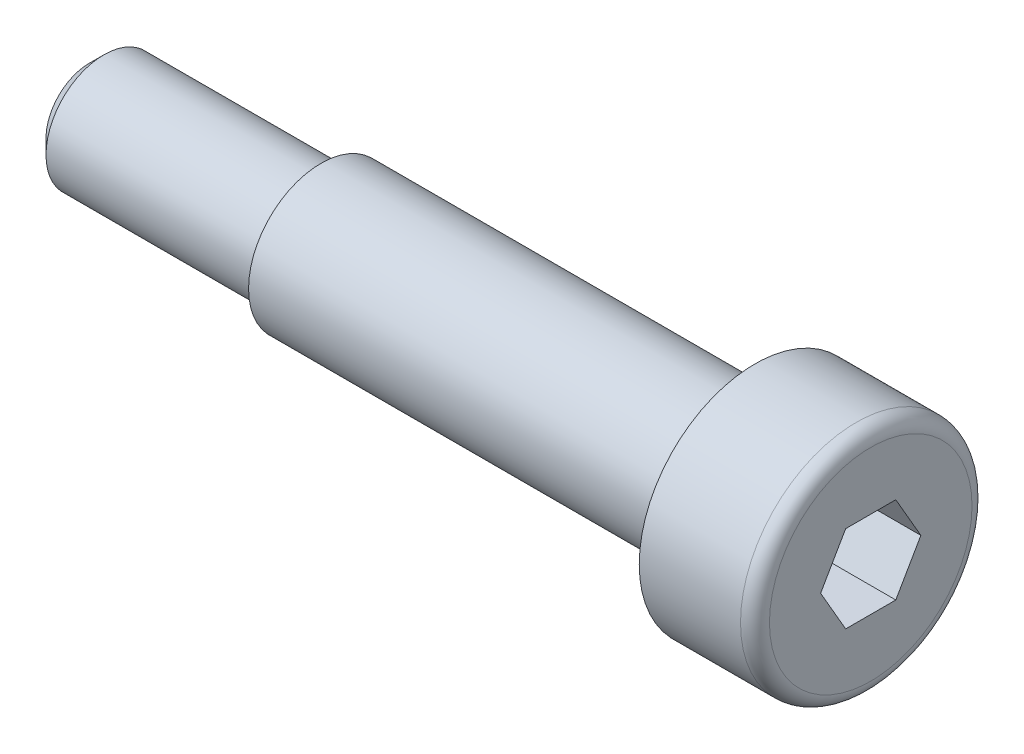
ISO-10303-21;
HEADER;
FILE_DESCRIPTION(('STEP AP214'),'2;1');
FILE_NAME('part.step','',(''),(''),'','','');
FILE_SCHEMA(('AUTOMOTIVE_DESIGN { 1 0 10303 214 1 1 1 1 }'));
ENDSEC;
DATA;
#1=APPLICATION_CONTEXT('core data for automotive mechanical design processes');
#2=APPLICATION_PROTOCOL_DEFINITION('international standard','automotive_design',2000,#1);
#3=PRODUCT_CONTEXT('',#1,'mechanical');
#4=PRODUCT('Part','Part','',(#3));
#5=PRODUCT_RELATED_PRODUCT_CATEGORY('part','',(#4));
#6=PRODUCT_DEFINITION_FORMATION('','',#4);
#7=PRODUCT_DEFINITION_CONTEXT('part definition',#1,'design');
#8=PRODUCT_DEFINITION('design','',#6,#7);
#9=PRODUCT_DEFINITION_SHAPE('','',#8);
#10=(LENGTH_UNIT() NAMED_UNIT(*) SI_UNIT(.MILLI.,.METRE.));
#11=(NAMED_UNIT(*) PLANE_ANGLE_UNIT() SI_UNIT($,.RADIAN.));
#12=(NAMED_UNIT(*) SI_UNIT($,.STERADIAN.) SOLID_ANGLE_UNIT());
#13=UNCERTAINTY_MEASURE_WITH_UNIT(LENGTH_MEASURE(1.E-05),#10,'distance_accuracy_value','');
#14=(GEOMETRIC_REPRESENTATION_CONTEXT(3) GLOBAL_UNCERTAINTY_ASSIGNED_CONTEXT((#13)) GLOBAL_UNIT_ASSIGNED_CONTEXT((#10,
#11,#12)) REPRESENTATION_CONTEXT('',''));
#15=CARTESIAN_POINT('',(0.,0.,0.));
#16=DIRECTION('',(0.,0.,1.));
#17=DIRECTION('',(1.,0.,0.));
#18=AXIS2_PLACEMENT_3D('',#15,#16,#17);
#19=CARTESIAN_POINT('',(0.,0.,0.));
#20=DIRECTION('',(-1.,0.,0.));
#21=DIRECTION('',(0.,0.,1.));
#22=AXIS2_PLACEMENT_3D('',#19,#20,#21);
#23=PLANE('',#22);
#24=DIRECTION('',(0.,0.866025403784439,0.5));
#25=VECTOR('',#24,1.);
#26=CARTESIAN_POINT('',(0.,0.,-1.73205080756888));
#27=LINE('',#26,#25);
#28=CARTESIAN_POINT('',(0.,0.,-1.73205080756888));
#29=VERTEX_POINT('',#28);
#30=CARTESIAN_POINT('',(0.,1.5,-0.866025403784438));
#31=VERTEX_POINT('',#30);
#32=EDGE_CURVE('E139',#29,#31,#27,.T.);
#33=ORIENTED_EDGE('',*,*,#32,.F.);
#34=DIRECTION('',(0.,0.866025403784439,-0.5));
#35=VECTOR('',#34,1.);
#36=CARTESIAN_POINT('',(0.,-1.5,-0.866025403784439));
#37=LINE('',#36,#35);
#38=CARTESIAN_POINT('',(0.,-1.5,-0.866025403784439));
#39=VERTEX_POINT('',#38);
#40=EDGE_CURVE('E59',#39,#29,#37,.T.);
#41=ORIENTED_EDGE('',*,*,#40,.F.);
#42=DIRECTION('',(0.,0.,-1.));
#43=VECTOR('',#42,1.);
#44=CARTESIAN_POINT('',(0.,-1.5,0.866025403784438));
#45=LINE('',#44,#43);
#46=CARTESIAN_POINT('',(0.,-1.5,0.866025403784438));
#47=VERTEX_POINT('',#46);
#48=EDGE_CURVE('E152',#47,#39,#45,.T.);
#49=ORIENTED_EDGE('',*,*,#48,.F.);
#50=DIRECTION('',(0.,-0.866025403784439,-0.5));
#51=VECTOR('',#50,1.);
#52=CARTESIAN_POINT('',(0.,0.,1.73205080756888));
#53=LINE('',#52,#51);
#54=CARTESIAN_POINT('',(0.,0.,1.73205080756888));
#55=VERTEX_POINT('',#54);
#56=EDGE_CURVE('E149',#55,#47,#53,.T.);
#57=ORIENTED_EDGE('',*,*,#56,.F.);
#58=DIRECTION('',(0.,-0.866025403784439,0.5));
#59=VECTOR('',#58,1.);
#60=CARTESIAN_POINT('',(0.,1.5,0.866025403784439));
#61=LINE('',#60,#59);
#62=CARTESIAN_POINT('',(0.,1.5,0.866025403784439));
#63=VERTEX_POINT('',#62);
#64=EDGE_CURVE('E107',#63,#55,#61,.T.);
#65=ORIENTED_EDGE('',*,*,#64,.F.);
#66=DIRECTION('',(0.,0.,1.));
#67=VECTOR('',#66,1.);
#68=CARTESIAN_POINT('',(0.,1.5,-0.866025403784438));
#69=LINE('',#68,#67);
#70=EDGE_CURVE('E143',#31,#63,#69,.T.);
#71=ORIENTED_EDGE('',*,*,#70,.F.);
#72=EDGE_LOOP('',(#33,#41,#49,#57,#65,#71));
#73=FACE_BOUND('',#72,.T.);
#74=CARTESIAN_POINT('',(0.,0.,0.));
#75=DIRECTION('',(-1.,0.,0.));
#76=DIRECTION('',(0.,0.,1.));
#77=AXIS2_PLACEMENT_3D('',#74,#75,#76);
#78=CIRCLE('',#77,3.5);
#79=CARTESIAN_POINT('',(0.,0.,3.5));
#80=VERTEX_POINT('',#79);
#81=EDGE_CURVE('E187',#80,#80,#78,.T.);
#82=ORIENTED_EDGE('',*,*,#81,.F.);
#83=EDGE_LOOP('',(#82));
#84=FACE_BOUND('',#83,.T.);
#85=ADVANCED_FACE('F43',(#73,#84),#23,.F.);
#86=CARTESIAN_POINT('',(-0.5,0.,0.));
#87=DIRECTION('',(-1.,0.,0.));
#88=DIRECTION('',(0.,0.,1.));
#89=AXIS2_PLACEMENT_3D('',#86,#87,#88);
#90=TOROIDAL_SURFACE('',#89,3.5,0.5);
#91=CARTESIAN_POINT('',(-0.5,0.,0.));
#92=DIRECTION('',(-1.,0.,0.));
#93=DIRECTION('',(0.,0.,1.));
#94=AXIS2_PLACEMENT_3D('',#91,#92,#93);
#95=CIRCLE('',#94,4.);
#96=CARTESIAN_POINT('',(-0.5,0.,4.));
#97=VERTEX_POINT('',#96);
#98=EDGE_CURVE('E183',#97,#97,#95,.T.);
#99=ORIENTED_EDGE('',*,*,#98,.F.);
#100=EDGE_LOOP('',(#99));
#101=FACE_BOUND('',#100,.T.);
#102=ORIENTED_EDGE('',*,*,#81,.T.);
#103=EDGE_LOOP('',(#102));
#104=FACE_BOUND('',#103,.T.);
#105=ADVANCED_FACE('F209',(#101,#104),#90,.T.);
#106=CARTESIAN_POINT('',(0.,0.,0.));
#107=DIRECTION('',(-1.,0.,0.));
#108=DIRECTION('',(0.,0.,1.));
#109=AXIS2_PLACEMENT_3D('',#106,#107,#108);
#110=CYLINDRICAL_SURFACE('',#109,4.);
#111=CARTESIAN_POINT('',(-4.,0.,0.));
#112=DIRECTION('',(-1.,0.,0.));
#113=DIRECTION('',(0.,0.,1.));
#114=AXIS2_PLACEMENT_3D('',#111,#112,#113);
#115=CIRCLE('',#114,4.);
#116=CARTESIAN_POINT('',(-4.,0.,4.));
#117=VERTEX_POINT('',#116);
#118=EDGE_CURVE('E179',#117,#117,#115,.T.);
#119=ORIENTED_EDGE('',*,*,#118,.F.);
#120=EDGE_LOOP('',(#119));
#121=FACE_BOUND('',#120,.T.);
#122=ORIENTED_EDGE('',*,*,#98,.T.);
#123=EDGE_LOOP('',(#122));
#124=FACE_BOUND('',#123,.T.);
#125=ADVANCED_FACE('F214',(#121,#124),#110,.T.);
#126=CARTESIAN_POINT('',(-4.,4.,0.));
#127=DIRECTION('',(1.,0.,0.));
#128=DIRECTION('',(0.,0.,-1.));
#129=AXIS2_PLACEMENT_3D('',#126,#127,#128);
#130=PLANE('',#129);
#131=CARTESIAN_POINT('',(-4.,0.,0.));
#132=DIRECTION('',(-1.,0.,0.));
#133=DIRECTION('',(0.,0.,1.));
#134=AXIS2_PLACEMENT_3D('',#131,#132,#133);
#135=CIRCLE('',#134,2.5);
#136=CARTESIAN_POINT('',(-4.,0.,2.5));
#137=VERTEX_POINT('',#136);
#138=EDGE_CURVE('E175',#137,#137,#135,.T.);
#139=ORIENTED_EDGE('',*,*,#138,.F.);
#140=EDGE_LOOP('',(#139));
#141=FACE_BOUND('',#140,.T.);
#142=ORIENTED_EDGE('',*,*,#118,.T.);
#143=EDGE_LOOP('',(#142));
#144=FACE_BOUND('',#143,.T.);
#145=ADVANCED_FACE('F222',(#141,#144),#130,.F.);
#146=CARTESIAN_POINT('',(0.,0.,0.));
#147=DIRECTION('',(-1.,0.,0.));
#148=DIRECTION('',(0.,0.,1.));
#149=AXIS2_PLACEMENT_3D('',#146,#147,#148);
#150=CYLINDRICAL_SURFACE('',#149,2.5);
#151=CARTESIAN_POINT('',(-19.,0.,0.));
#152=DIRECTION('',(-1.,0.,0.));
#153=DIRECTION('',(0.,0.,1.));
#154=AXIS2_PLACEMENT_3D('',#151,#152,#153);
#155=CIRCLE('',#154,2.5);
#156=CARTESIAN_POINT('',(-19.,0.,2.5));
#157=VERTEX_POINT('',#156);
#158=EDGE_CURVE('E171',#157,#157,#155,.T.);
#159=ORIENTED_EDGE('',*,*,#158,.F.);
#160=EDGE_LOOP('',(#159));
#161=FACE_BOUND('',#160,.T.);
#162=ORIENTED_EDGE('',*,*,#138,.T.);
#163=EDGE_LOOP('',(#162));
#164=FACE_BOUND('',#163,.T.);
#165=ADVANCED_FACE('F226',(#161,#164),#150,.T.);
#166=CARTESIAN_POINT('',(-19.,2.5,0.));
#167=DIRECTION('',(1.,0.,0.));
#168=DIRECTION('',(0.,0.,-1.));
#169=AXIS2_PLACEMENT_3D('',#166,#167,#168);
#170=PLANE('',#169);
#171=CARTESIAN_POINT('',(-19.,0.,0.));
#172=DIRECTION('',(-1.,0.,0.));
#173=DIRECTION('',(0.,0.,1.));
#174=AXIS2_PLACEMENT_3D('',#171,#172,#173);
#175=CIRCLE('',#174,2.);
#176=CARTESIAN_POINT('',(-19.,0.,2.));
#177=VERTEX_POINT('',#176);
#178=EDGE_CURVE('E158',#177,#177,#175,.T.);
#179=ORIENTED_EDGE('',*,*,#178,.F.);
#180=EDGE_LOOP('',(#179));
#181=FACE_BOUND('',#180,.T.);
#182=ORIENTED_EDGE('',*,*,#158,.T.);
#183=EDGE_LOOP('',(#182));
#184=FACE_BOUND('',#183,.T.);
#185=ADVANCED_FACE('F230',(#181,#184),#170,.F.);
#186=CARTESIAN_POINT('',(0.,0.,0.));
#187=DIRECTION('',(-1.,0.,0.));
#188=DIRECTION('',(0.,0.,1.));
#189=AXIS2_PLACEMENT_3D('',#186,#187,#188);
#190=CYLINDRICAL_SURFACE('',#189,2.);
#191=CARTESIAN_POINT('',(-26.5,0.,0.));
#192=DIRECTION('',(1.,0.,0.));
#193=DIRECTION('',(0.,0.,-1.));
#194=AXIS2_PLACEMENT_3D('',#191,#192,#193);
#195=CIRCLE('',#194,2.);
#196=CARTESIAN_POINT('',(-26.5,0.,-2.));
#197=VERTEX_POINT('',#196);
#198=EDGE_CURVE('E11',#197,#197,#195,.T.);
#199=ORIENTED_EDGE('',*,*,#198,.T.);
#200=EDGE_LOOP('',(#199));
#201=FACE_BOUND('',#200,.T.);
#202=ORIENTED_EDGE('',*,*,#178,.T.);
#203=EDGE_LOOP('',(#202));
#204=FACE_BOUND('',#203,.T.);
#205=ADVANCED_FACE('F205',(#201,#204),#190,.T.);
#206=CARTESIAN_POINT('',(-27.,2.,0.));
#207=DIRECTION('',(1.,0.,0.));
#208=DIRECTION('',(0.,0.,-1.));
#209=AXIS2_PLACEMENT_3D('',#206,#207,#208);
#210=PLANE('',#209);
#211=CARTESIAN_POINT('',(-27.,0.,0.));
#212=DIRECTION('',(1.,0.,0.));
#213=DIRECTION('',(0.,0.,-1.));
#214=AXIS2_PLACEMENT_3D('',#211,#212,#213);
#215=CIRCLE('',#214,1.5);
#216=CARTESIAN_POINT('',(-27.,0.,-1.5));
#217=VERTEX_POINT('',#216);
#218=EDGE_CURVE('E52',#217,#217,#215,.F.);
#219=ORIENTED_EDGE('',*,*,#218,.T.);
#220=EDGE_LOOP('',(#219));
#221=FACE_BOUND('',#220,.T.);
#222=ADVANCED_FACE('F194',(#221),#210,.F.);
#223=CARTESIAN_POINT('',(-27.,0.,0.));
#224=DIRECTION('',(1.,0.,0.));
#225=DIRECTION('',(0.,0.,-1.));
#226=AXIS2_PLACEMENT_3D('',#223,#224,#225);
#227=CONICAL_SURFACE('',#226,1.5,0.785398163397449);
#228=ORIENTED_EDGE('',*,*,#198,.F.);
#229=EDGE_LOOP('',(#228));
#230=FACE_BOUND('',#229,.T.);
#231=ORIENTED_EDGE('',*,*,#218,.F.);
#232=EDGE_LOOP('',(#231));
#233=FACE_BOUND('',#232,.T.);
#234=ADVANCED_FACE('F45',(#230,#233),#227,.T.);
#235=CARTESIAN_POINT('',(-2.4,-1.5,-0.866025403784439));
#236=DIRECTION('',(0.,-0.5,-0.866025403784439));
#237=DIRECTION('',(0.,0.866025403784439,-0.5));
#238=AXIS2_PLACEMENT_3D('',#235,#236,#237);
#239=PLANE('',#238);
#240=ORIENTED_EDGE('',*,*,#40,.T.);
#241=DIRECTION('',(1.,0.,0.));
#242=VECTOR('',#241,1.);
#243=CARTESIAN_POINT('',(-2.4,0.,-1.73205080756888));
#244=LINE('',#243,#242);
#245=CARTESIAN_POINT('',(-2.4,0.,-1.73205080756888));
#246=VERTEX_POINT('',#245);
#247=EDGE_CURVE('E89',#246,#29,#244,.T.);
#248=ORIENTED_EDGE('',*,*,#247,.F.);
#249=DIRECTION('',(0.,0.866025403784439,-0.5));
#250=VECTOR('',#249,1.);
#251=CARTESIAN_POINT('',(-2.4,-1.5,-0.866025403784439));
#252=LINE('',#251,#250);
#253=CARTESIAN_POINT('',(-2.4,-1.5,-0.866025403784439));
#254=VERTEX_POINT('',#253);
#255=EDGE_CURVE('E155',#254,#246,#252,.T.);
#256=ORIENTED_EDGE('',*,*,#255,.F.);
#257=DIRECTION('',(1.,0.,0.));
#258=VECTOR('',#257,1.);
#259=CARTESIAN_POINT('',(-2.4,-1.5,-0.866025403784439));
#260=LINE('',#259,#258);
#261=EDGE_CURVE('E67',#254,#39,#260,.T.);
#262=ORIENTED_EDGE('',*,*,#261,.T.);
#263=EDGE_LOOP('',(#240,#248,#256,#262));
#264=FACE_BOUND('',#263,.T.);
#265=ADVANCED_FACE('F197',(#264),#239,.F.);
#266=CARTESIAN_POINT('',(-2.4,-1.5,0.866025403784438));
#267=DIRECTION('',(0.,-1.,0.));
#268=DIRECTION('',(0.,0.,-1.));
#269=AXIS2_PLACEMENT_3D('',#266,#267,#268);
#270=PLANE('',#269);
#271=ORIENTED_EDGE('',*,*,#48,.T.);
#272=ORIENTED_EDGE('',*,*,#261,.F.);
#273=DIRECTION('',(0.,0.,-1.));
#274=VECTOR('',#273,1.);
#275=CARTESIAN_POINT('',(-2.4,-1.5,0.866025403784438));
#276=LINE('',#275,#274);
#277=CARTESIAN_POINT('',(-2.4,-1.5,0.866025403784438));
#278=VERTEX_POINT('',#277);
#279=EDGE_CURVE('E121',#278,#254,#276,.T.);
#280=ORIENTED_EDGE('',*,*,#279,.F.);
#281=DIRECTION('',(1.,0.,0.));
#282=VECTOR('',#281,1.);
#283=CARTESIAN_POINT('',(-2.4,-1.5,0.866025403784438));
#284=LINE('',#283,#282);
#285=EDGE_CURVE('E112',#278,#47,#284,.T.);
#286=ORIENTED_EDGE('',*,*,#285,.T.);
#287=EDGE_LOOP('',(#271,#272,#280,#286));
#288=FACE_BOUND('',#287,.T.);
#289=ADVANCED_FACE('F203',(#288),#270,.F.);
#290=CARTESIAN_POINT('',(-2.4,0.,1.73205080756888));
#291=DIRECTION('',(0.,-0.5,0.866025403784439));
#292=DIRECTION('',(0.,-0.866025403784439,-0.5));
#293=AXIS2_PLACEMENT_3D('',#290,#291,#292);
#294=PLANE('',#293);
#295=ORIENTED_EDGE('',*,*,#56,.T.);
#296=ORIENTED_EDGE('',*,*,#285,.F.);
#297=DIRECTION('',(0.,-0.866025403784439,-0.5));
#298=VECTOR('',#297,1.);
#299=CARTESIAN_POINT('',(-2.4,0.,1.73205080756888));
#300=LINE('',#299,#298);
#301=CARTESIAN_POINT('',(-2.4,0.,1.73205080756888));
#302=VERTEX_POINT('',#301);
#303=EDGE_CURVE('E116',#302,#278,#300,.T.);
#304=ORIENTED_EDGE('',*,*,#303,.F.);
#305=DIRECTION('',(1.,0.,0.));
#306=VECTOR('',#305,1.);
#307=CARTESIAN_POINT('',(-2.4,0.,1.73205080756888));
#308=LINE('',#307,#306);
#309=EDGE_CURVE('E100',#302,#55,#308,.T.);
#310=ORIENTED_EDGE('',*,*,#309,.T.);
#311=EDGE_LOOP('',(#295,#296,#304,#310));
#312=FACE_BOUND('',#311,.T.);
#313=ADVANCED_FACE('F117',(#312),#294,.F.);
#314=CARTESIAN_POINT('',(-2.4,1.5,0.866025403784439));
#315=DIRECTION('',(0.,0.5,0.866025403784439));
#316=DIRECTION('',(0.,-0.866025403784439,0.5));
#317=AXIS2_PLACEMENT_3D('',#314,#315,#316);
#318=PLANE('',#317);
#319=ORIENTED_EDGE('',*,*,#64,.T.);
#320=ORIENTED_EDGE('',*,*,#309,.F.);
#321=DIRECTION('',(0.,-0.866025403784439,0.5));
#322=VECTOR('',#321,1.);
#323=CARTESIAN_POINT('',(-2.4,1.5,0.866025403784439));
#324=LINE('',#323,#322);
#325=CARTESIAN_POINT('',(-2.4,1.5,0.866025403784439));
#326=VERTEX_POINT('',#325);
#327=EDGE_CURVE('E104',#326,#302,#324,.T.);
#328=ORIENTED_EDGE('',*,*,#327,.F.);
#329=DIRECTION('',(1.,0.,0.));
#330=VECTOR('',#329,1.);
#331=CARTESIAN_POINT('',(-2.4,1.5,0.866025403784439));
#332=LINE('',#331,#330);
#333=EDGE_CURVE('E113',#326,#63,#332,.T.);
#334=ORIENTED_EDGE('',*,*,#333,.T.);
#335=EDGE_LOOP('',(#319,#320,#328,#334));
#336=FACE_BOUND('',#335,.T.);
#337=ADVANCED_FACE('F102',(#336),#318,.F.);
#338=CARTESIAN_POINT('',(-2.4,1.5,-0.866025403784438));
#339=DIRECTION('',(0.,1.,0.));
#340=DIRECTION('',(0.,0.,1.));
#341=AXIS2_PLACEMENT_3D('',#338,#339,#340);
#342=PLANE('',#341);
#343=ORIENTED_EDGE('',*,*,#70,.T.);
#344=ORIENTED_EDGE('',*,*,#333,.F.);
#345=DIRECTION('',(0.,0.,1.));
#346=VECTOR('',#345,1.);
#347=CARTESIAN_POINT('',(-2.4,1.5,-0.866025403784438));
#348=LINE('',#347,#346);
#349=CARTESIAN_POINT('',(-2.4,1.5,-0.866025403784438));
#350=VERTEX_POINT('',#349);
#351=EDGE_CURVE('E127',#350,#326,#348,.T.);
#352=ORIENTED_EDGE('',*,*,#351,.F.);
#353=DIRECTION('',(1.,0.,0.));
#354=VECTOR('',#353,1.);
#355=CARTESIAN_POINT('',(-2.4,1.5,-0.866025403784438));
#356=LINE('',#355,#354);
#357=EDGE_CURVE('E163',#350,#31,#356,.T.);
#358=ORIENTED_EDGE('',*,*,#357,.T.);
#359=EDGE_LOOP('',(#343,#344,#352,#358));
#360=FACE_BOUND('',#359,.T.);
#361=ADVANCED_FACE('F241',(#360),#342,.F.);
#362=CARTESIAN_POINT('',(-2.4,0.,-1.73205080756888));
#363=DIRECTION('',(0.,0.5,-0.866025403784438));
#364=DIRECTION('',(0.,0.866025403784439,0.5));
#365=AXIS2_PLACEMENT_3D('',#362,#363,#364);
#366=PLANE('',#365);
#367=ORIENTED_EDGE('',*,*,#32,.T.);
#368=ORIENTED_EDGE('',*,*,#357,.F.);
#369=DIRECTION('',(0.,0.866025403784439,0.5));
#370=VECTOR('',#369,1.);
#371=CARTESIAN_POINT('',(-2.4,0.,-1.73205080756888));
#372=LINE('',#371,#370);
#373=EDGE_CURVE('E131',#246,#350,#372,.T.);
#374=ORIENTED_EDGE('',*,*,#373,.F.);
#375=ORIENTED_EDGE('',*,*,#247,.T.);
#376=EDGE_LOOP('',(#367,#368,#374,#375));
#377=FACE_BOUND('',#376,.T.);
#378=ADVANCED_FACE('F238',(#377),#366,.F.);
#379=CARTESIAN_POINT('',(-2.4,0.,0.));
#380=DIRECTION('',(1.,0.,0.));
#381=DIRECTION('',(0.,0.,-1.));
#382=AXIS2_PLACEMENT_3D('',#379,#380,#381);
#383=PLANE('',#382);
#384=ORIENTED_EDGE('',*,*,#255,.T.);
#385=ORIENTED_EDGE('',*,*,#373,.T.);
#386=ORIENTED_EDGE('',*,*,#351,.T.);
#387=ORIENTED_EDGE('',*,*,#327,.T.);
#388=ORIENTED_EDGE('',*,*,#303,.T.);
#389=ORIENTED_EDGE('',*,*,#279,.T.);
#390=EDGE_LOOP('',(#384,#385,#386,#387,#388,#389));
#391=FACE_BOUND('',#390,.T.);
#392=ADVANCED_FACE('F124',(#391),#383,.T.);
#393=CLOSED_SHELL('',(#85,#105,#125,#145,#165,#185,#205,#222,#234,#265,#289,#313,#337,#361,#378,#392));
#394=MANIFOLD_SOLID_BREP('B2',#393);
#395=ADVANCED_BREP_SHAPE_REPRESENTATION('',(#18,#394),#14);
#396=SHAPE_DEFINITION_REPRESENTATION(#9,#395);
ENDSEC;
END-ISO-10303-21;
